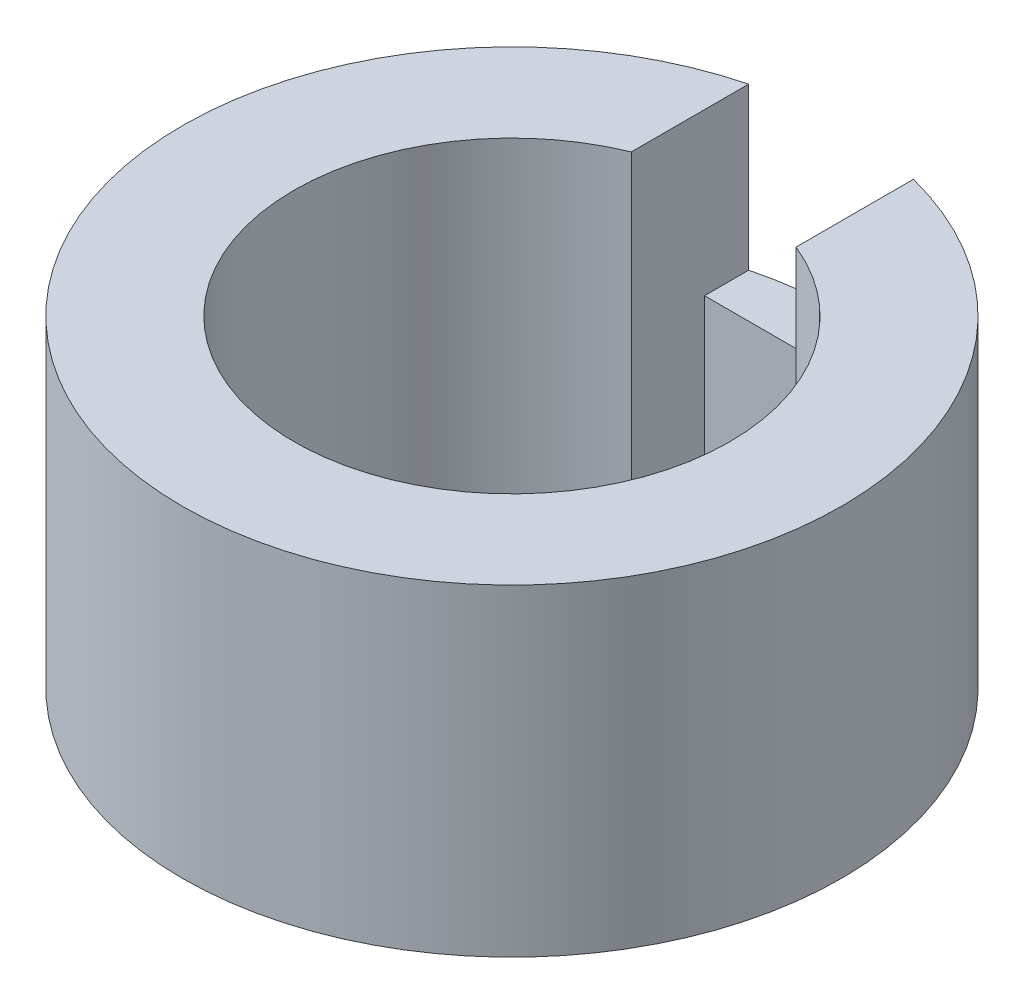
ISO-10303-21;
HEADER;
FILE_DESCRIPTION(('STEP AP214'),'2;1');
FILE_NAME('part.step','',(''),(''),'','','');
FILE_SCHEMA(('AUTOMOTIVE_DESIGN { 1 0 10303 214 1 1 1 1 }'));
ENDSEC;
DATA;
#1=APPLICATION_CONTEXT('core data for automotive mechanical design processes');
#2=APPLICATION_PROTOCOL_DEFINITION('international standard','automotive_design',2000,#1);
#3=PRODUCT_CONTEXT('',#1,'mechanical');
#4=PRODUCT('Part','Part','',(#3));
#5=PRODUCT_RELATED_PRODUCT_CATEGORY('part','',(#4));
#6=PRODUCT_DEFINITION_FORMATION('','',#4);
#7=PRODUCT_DEFINITION_CONTEXT('part definition',#1,'design');
#8=PRODUCT_DEFINITION('design','',#6,#7);
#9=PRODUCT_DEFINITION_SHAPE('','',#8);
#10=(LENGTH_UNIT() NAMED_UNIT(*) SI_UNIT(.MILLI.,.METRE.));
#11=(NAMED_UNIT(*) PLANE_ANGLE_UNIT() SI_UNIT($,.RADIAN.));
#12=(NAMED_UNIT(*) SI_UNIT($,.STERADIAN.) SOLID_ANGLE_UNIT());
#13=UNCERTAINTY_MEASURE_WITH_UNIT(LENGTH_MEASURE(1.E-05),#10,'distance_accuracy_value','');
#14=(GEOMETRIC_REPRESENTATION_CONTEXT(3) GLOBAL_UNCERTAINTY_ASSIGNED_CONTEXT((#13)) GLOBAL_UNIT_ASSIGNED_CONTEXT((#10,
#11,#12)) REPRESENTATION_CONTEXT('',''));
#15=CARTESIAN_POINT('',(0.,0.,0.));
#16=DIRECTION('',(0.,0.,1.));
#17=DIRECTION('',(1.,0.,0.));
#18=AXIS2_PLACEMENT_3D('',#15,#16,#17);
#19=CARTESIAN_POINT('',(0.,8.8,0.));
#20=DIRECTION('',(0.,-1.,0.));
#21=DIRECTION('',(0.,0.,-1.));
#22=AXIS2_PLACEMENT_3D('',#19,#20,#21);
#23=CYLINDRICAL_SURFACE('',#22,5.95);
#24=CARTESIAN_POINT('',(0.,0.,0.));
#25=DIRECTION('',(0.,1.,0.));
#26=DIRECTION('',(0.,0.,1.));
#27=AXIS2_PLACEMENT_3D('',#24,#25,#26);
#28=CIRCLE('',#27,5.95);
#29=CARTESIAN_POINT('',(-2.25,0.,-5.50817574156816));
#30=VERTEX_POINT('',#29);
#31=CARTESIAN_POINT('',(2.25,0.,-5.50817574156816));
#32=VERTEX_POINT('',#31);
#33=EDGE_CURVE('E81',#30,#32,#28,.T.);
#34=ORIENTED_EDGE('',*,*,#33,.F.);
#35=DIRECTION('',(0.,-1.,0.));
#36=VECTOR('',#35,1.);
#37=CARTESIAN_POINT('',(-2.25,8.8,-5.50817574156816));
#38=LINE('',#37,#36);
#39=CARTESIAN_POINT('',(-2.25,8.8,-5.50817574156816));
#40=VERTEX_POINT('',#39);
#41=EDGE_CURVE('E47',#40,#30,#38,.T.);
#42=ORIENTED_EDGE('',*,*,#41,.F.);
#43=CARTESIAN_POINT('',(0.,8.8,0.));
#44=DIRECTION('',(0.,1.,0.));
#45=DIRECTION('',(0.,0.,1.));
#46=AXIS2_PLACEMENT_3D('',#43,#44,#45);
#47=CIRCLE('',#46,5.95);
#48=CARTESIAN_POINT('',(2.25,8.8,-5.50817574156816));
#49=VERTEX_POINT('',#48);
#50=EDGE_CURVE('E82',#40,#49,#47,.T.);
#51=ORIENTED_EDGE('',*,*,#50,.T.);
#52=DIRECTION('',(0.,-1.,0.));
#53=VECTOR('',#52,1.);
#54=CARTESIAN_POINT('',(2.25,8.8,-5.50817574156816));
#55=LINE('',#54,#53);
#56=EDGE_CURVE('E79',#49,#32,#55,.T.);
#57=ORIENTED_EDGE('',*,*,#56,.T.);
#58=EDGE_LOOP('',(#34,#42,#51,#57));
#59=FACE_BOUND('',#58,.T.);
#60=ADVANCED_FACE('F39',(#59),#23,.F.);
#61=CARTESIAN_POINT('',(-2.25,8.8,0.));
#62=DIRECTION('',(-1.,0.,0.));
#63=DIRECTION('',(0.,0.,1.));
#64=AXIS2_PLACEMENT_3D('',#61,#62,#63);
#65=PLANE('',#64);
#66=DIRECTION('',(0.,-1.,0.));
#67=VECTOR('',#66,1.);
#68=CARTESIAN_POINT('',(-2.25,8.8,-7.50817574156816));
#69=LINE('',#68,#67);
#70=CARTESIAN_POINT('',(-2.25,4.4,-7.50817574156816));
#71=VERTEX_POINT('',#70);
#72=CARTESIAN_POINT('',(-2.25,0.,-7.50817574156816));
#73=VERTEX_POINT('',#72);
#74=EDGE_CURVE('E111',#71,#73,#69,.T.);
#75=ORIENTED_EDGE('',*,*,#74,.F.);
#76=DIRECTION('',(0.,0.,1.));
#77=VECTOR('',#76,1.);
#78=CARTESIAN_POINT('',(-2.25,4.4,-9.));
#79=LINE('',#78,#77);
#80=CARTESIAN_POINT('',(-2.25,4.4,-8.71421252896669));
#81=VERTEX_POINT('',#80);
#82=EDGE_CURVE('E144',#81,#71,#79,.T.);
#83=ORIENTED_EDGE('',*,*,#82,.F.);
#84=DIRECTION('',(0.,-1.,0.));
#85=VECTOR('',#84,1.);
#86=CARTESIAN_POINT('',(-2.25,8.8,-8.71421252896669));
#87=LINE('',#86,#85);
#88=CARTESIAN_POINT('',(-2.25,8.8,-8.71421252896669));
#89=VERTEX_POINT('',#88);
#90=EDGE_CURVE('E102',#89,#81,#87,.T.);
#91=ORIENTED_EDGE('',*,*,#90,.F.);
#92=DIRECTION('',(0.,0.,-1.));
#93=VECTOR('',#92,1.);
#94=CARTESIAN_POINT('',(-2.25,8.8,0.));
#95=LINE('',#94,#93);
#96=EDGE_CURVE('E118',#40,#89,#95,.T.);
#97=ORIENTED_EDGE('',*,*,#96,.F.);
#98=ORIENTED_EDGE('',*,*,#41,.T.);
#99=DIRECTION('',(0.,0.,-1.));
#100=VECTOR('',#99,1.);
#101=CARTESIAN_POINT('',(-2.25,0.,0.));
#102=LINE('',#101,#100);
#103=EDGE_CURVE('E97',#30,#73,#102,.T.);
#104=ORIENTED_EDGE('',*,*,#103,.T.);
#105=EDGE_LOOP('',(#75,#83,#91,#97,#98,#104));
#106=FACE_BOUND('',#105,.T.);
#107=ADVANCED_FACE('F115',(#106),#65,.F.);
#108=CARTESIAN_POINT('',(0.,8.8,-7.50817574156816));
#109=DIRECTION('',(0.,0.,-1.));
#110=DIRECTION('',(-1.,0.,0.));
#111=AXIS2_PLACEMENT_3D('',#108,#109,#110);
#112=PLANE('',#111);
#113=DIRECTION('',(0.,-1.,0.));
#114=VECTOR('',#113,1.);
#115=CARTESIAN_POINT('',(2.25,8.8,-7.50817574156816));
#116=LINE('',#115,#114);
#117=CARTESIAN_POINT('',(2.25,4.4,-7.50817574156816));
#118=VERTEX_POINT('',#117);
#119=CARTESIAN_POINT('',(2.25,0.,-7.50817574156816));
#120=VERTEX_POINT('',#119);
#121=EDGE_CURVE('E73',#118,#120,#116,.T.);
#122=ORIENTED_EDGE('',*,*,#121,.F.);
#123=DIRECTION('',(-1.,0.,0.));
#124=VECTOR('',#123,1.);
#125=CARTESIAN_POINT('',(0.,4.4,-7.50817574156816));
#126=LINE('',#125,#124);
#127=EDGE_CURVE('E98',#118,#71,#126,.T.);
#128=ORIENTED_EDGE('',*,*,#127,.T.);
#129=ORIENTED_EDGE('',*,*,#74,.T.);
#130=DIRECTION('',(1.,0.,0.));
#131=VECTOR('',#130,1.);
#132=CARTESIAN_POINT('',(0.,0.,-7.50817574156816));
#133=LINE('',#132,#131);
#134=EDGE_CURVE('E91',#73,#120,#133,.T.);
#135=ORIENTED_EDGE('',*,*,#134,.T.);
#136=EDGE_LOOP('',(#122,#128,#129,#135));
#137=FACE_BOUND('',#136,.T.);
#138=ADVANCED_FACE('F150',(#137),#112,.F.);
#139=CARTESIAN_POINT('',(2.25,8.8,0.));
#140=DIRECTION('',(1.,0.,0.));
#141=DIRECTION('',(0.,0.,-1.));
#142=AXIS2_PLACEMENT_3D('',#139,#140,#141);
#143=PLANE('',#142);
#144=DIRECTION('',(0.,0.,1.));
#145=VECTOR('',#144,1.);
#146=CARTESIAN_POINT('',(2.25,0.,0.));
#147=LINE('',#146,#145);
#148=EDGE_CURVE('E86',#120,#32,#147,.T.);
#149=ORIENTED_EDGE('',*,*,#148,.T.);
#150=ORIENTED_EDGE('',*,*,#56,.F.);
#151=DIRECTION('',(0.,0.,1.));
#152=VECTOR('',#151,1.);
#153=CARTESIAN_POINT('',(2.25,8.8,0.));
#154=LINE('',#153,#152);
#155=CARTESIAN_POINT('',(2.25,8.8,-8.71421252896669));
#156=VERTEX_POINT('',#155);
#157=EDGE_CURVE('E55',#156,#49,#154,.T.);
#158=ORIENTED_EDGE('',*,*,#157,.F.);
#159=DIRECTION('',(0.,-1.,0.));
#160=VECTOR('',#159,1.);
#161=CARTESIAN_POINT('',(2.25,8.8,-8.71421252896669));
#162=LINE('',#161,#160);
#163=CARTESIAN_POINT('',(2.25,4.4,-8.71421252896669));
#164=VERTEX_POINT('',#163);
#165=EDGE_CURVE('E136',#164,#156,#162,.F.);
#166=ORIENTED_EDGE('',*,*,#165,.F.);
#167=DIRECTION('',(0.,0.,1.));
#168=VECTOR('',#167,1.);
#169=CARTESIAN_POINT('',(2.25,4.4,-9.));
#170=LINE('',#169,#168);
#171=EDGE_CURVE('E147',#164,#118,#170,.T.);
#172=ORIENTED_EDGE('',*,*,#171,.T.);
#173=ORIENTED_EDGE('',*,*,#121,.T.);
#174=EDGE_LOOP('',(#149,#150,#158,#166,#172,#173));
#175=FACE_BOUND('',#174,.T.);
#176=ADVANCED_FACE('F87',(#175),#143,.F.);
#177=CARTESIAN_POINT('',(0.,8.8,0.));
#178=DIRECTION('',(0.,-1.,0.));
#179=DIRECTION('',(0.,0.,-1.));
#180=AXIS2_PLACEMENT_3D('',#177,#178,#179);
#181=CYLINDRICAL_SURFACE('',#180,9.);
#182=CARTESIAN_POINT('',(0.,4.4,0.));
#183=DIRECTION('',(0.,-1.,0.));
#184=DIRECTION('',(0.,0.,-1.));
#185=AXIS2_PLACEMENT_3D('',#182,#183,#184);
#186=CIRCLE('',#185,9.);
#187=EDGE_CURVE('E11',#81,#164,#186,.T.);
#188=ORIENTED_EDGE('',*,*,#187,.T.);
#189=ORIENTED_EDGE('',*,*,#165,.T.);
#190=CARTESIAN_POINT('',(0.,8.8,0.));
#191=DIRECTION('',(0.,1.,0.));
#192=DIRECTION('',(0.,0.,1.));
#193=AXIS2_PLACEMENT_3D('',#190,#191,#192);
#194=CIRCLE('',#193,9.);
#195=EDGE_CURVE('E83',#89,#156,#194,.T.);
#196=ORIENTED_EDGE('',*,*,#195,.F.);
#197=ORIENTED_EDGE('',*,*,#90,.T.);
#198=EDGE_LOOP('',(#188,#189,#196,#197));
#199=FACE_BOUND('',#198,.T.);
#200=CARTESIAN_POINT('',(0.,0.,0.));
#201=DIRECTION('',(0.,1.,0.));
#202=DIRECTION('',(0.,0.,1.));
#203=AXIS2_PLACEMENT_3D('',#200,#201,#202);
#204=CIRCLE('',#203,9.);
#205=CARTESIAN_POINT('',(0.,0.,9.));
#206=VERTEX_POINT('',#205);
#207=EDGE_CURVE('E90',#206,#206,#204,.T.);
#208=ORIENTED_EDGE('',*,*,#207,.T.);
#209=EDGE_LOOP('',(#208));
#210=FACE_BOUND('',#209,.T.);
#211=ADVANCED_FACE('F132',(#199,#210),#181,.T.);
#212=CARTESIAN_POINT('',(0.,8.8,0.));
#213=DIRECTION('',(0.,1.,0.));
#214=DIRECTION('',(0.,0.,1.));
#215=AXIS2_PLACEMENT_3D('',#212,#213,#214);
#216=PLANE('',#215);
#217=ORIENTED_EDGE('',*,*,#96,.T.);
#218=ORIENTED_EDGE('',*,*,#195,.T.);
#219=ORIENTED_EDGE('',*,*,#157,.T.);
#220=ORIENTED_EDGE('',*,*,#50,.F.);
#221=EDGE_LOOP('',(#217,#218,#219,#220));
#222=FACE_BOUND('',#221,.T.);
#223=ADVANCED_FACE('F124',(#222),#216,.T.);
#224=CARTESIAN_POINT('',(0.,0.,0.));
#225=DIRECTION('',(0.,1.,0.));
#226=DIRECTION('',(0.,0.,1.));
#227=AXIS2_PLACEMENT_3D('',#224,#225,#226);
#228=PLANE('',#227);
#229=ORIENTED_EDGE('',*,*,#33,.T.);
#230=ORIENTED_EDGE('',*,*,#148,.F.);
#231=ORIENTED_EDGE('',*,*,#134,.F.);
#232=ORIENTED_EDGE('',*,*,#103,.F.);
#233=EDGE_LOOP('',(#229,#230,#231,#232));
#234=FACE_BOUND('',#233,.T.);
#235=ORIENTED_EDGE('',*,*,#207,.F.);
#236=EDGE_LOOP('',(#235));
#237=FACE_BOUND('',#236,.T.);
#238=ADVANCED_FACE('F94',(#234,#237),#228,.F.);
#239=CARTESIAN_POINT('',(-2.25,4.4,-9.));
#240=DIRECTION('',(0.,-1.,0.));
#241=DIRECTION('',(0.,0.,-1.));
#242=AXIS2_PLACEMENT_3D('',#239,#240,#241);
#243=PLANE('',#242);
#244=ORIENTED_EDGE('',*,*,#171,.F.);
#245=ORIENTED_EDGE('',*,*,#187,.F.);
#246=ORIENTED_EDGE('',*,*,#82,.T.);
#247=ORIENTED_EDGE('',*,*,#127,.F.);
#248=EDGE_LOOP('',(#244,#245,#246,#247));
#249=FACE_BOUND('',#248,.T.);
#250=ADVANCED_FACE('F146',(#249),#243,.F.);
#251=CLOSED_SHELL('',(#60,#107,#138,#176,#211,#223,#238,#250));
#252=MANIFOLD_SOLID_BREP('B2',#251);
#253=ADVANCED_BREP_SHAPE_REPRESENTATION('',(#18,#252),#14);
#254=SHAPE_DEFINITION_REPRESENTATION(#9,#253);
ENDSEC;
END-ISO-10303-21;
